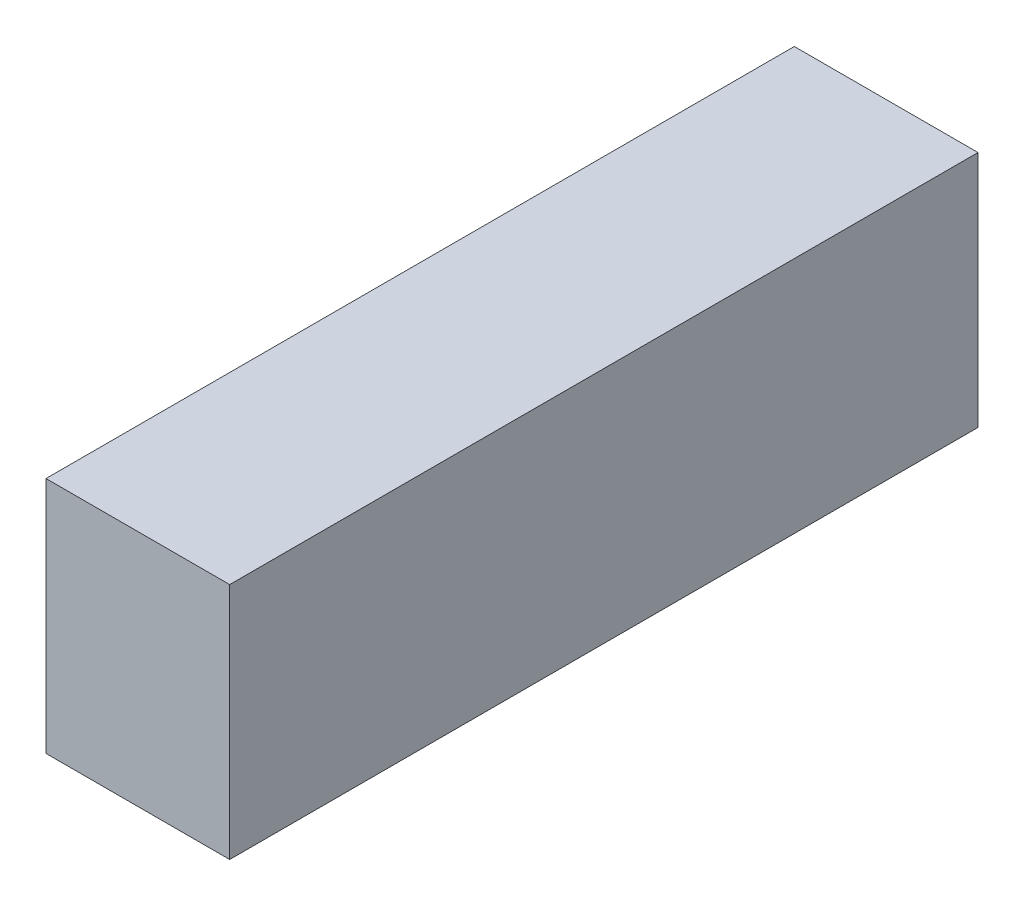
ISO-10303-21;
HEADER;
FILE_DESCRIPTION(('STEP AP214'),'2;1');
FILE_NAME('part.step','',(''),(''),'','','');
FILE_SCHEMA(('AUTOMOTIVE_DESIGN { 1 0 10303 214 1 1 1 1 }'));
ENDSEC;
DATA;
#1=APPLICATION_CONTEXT('core data for automotive mechanical design processes');
#2=APPLICATION_PROTOCOL_DEFINITION('international standard','automotive_design',2000,#1);
#3=PRODUCT_CONTEXT('',#1,'mechanical');
#4=PRODUCT('Part','Part','',(#3));
#5=PRODUCT_RELATED_PRODUCT_CATEGORY('part','',(#4));
#6=PRODUCT_DEFINITION_FORMATION('','',#4);
#7=PRODUCT_DEFINITION_CONTEXT('part definition',#1,'design');
#8=PRODUCT_DEFINITION('design','',#6,#7);
#9=PRODUCT_DEFINITION_SHAPE('','',#8);
#10=(LENGTH_UNIT() NAMED_UNIT(*) SI_UNIT(.MILLI.,.METRE.));
#11=(NAMED_UNIT(*) PLANE_ANGLE_UNIT() SI_UNIT($,.RADIAN.));
#12=(NAMED_UNIT(*) SI_UNIT($,.STERADIAN.) SOLID_ANGLE_UNIT());
#13=UNCERTAINTY_MEASURE_WITH_UNIT(LENGTH_MEASURE(1.E-05),#10,'distance_accuracy_value','');
#14=(GEOMETRIC_REPRESENTATION_CONTEXT(3) GLOBAL_UNCERTAINTY_ASSIGNED_CONTEXT((#13)) GLOBAL_UNIT_ASSIGNED_CONTEXT((#10,
#11,#12)) REPRESENTATION_CONTEXT('',''));
#15=CARTESIAN_POINT('',(0.,0.,0.));
#16=DIRECTION('',(0.,0.,1.));
#17=DIRECTION('',(1.,0.,0.));
#18=AXIS2_PLACEMENT_3D('',#15,#16,#17);
#19=CARTESIAN_POINT('',(8.57249999999999,11.1125,34.925));
#20=DIRECTION('',(-1.,0.,0.));
#21=DIRECTION('',(0.,0.,1.));
#22=AXIS2_PLACEMENT_3D('',#19,#20,#21);
#23=PLANE('',#22);
#24=DIRECTION('',(0.,0.,-1.));
#25=VECTOR('',#24,1.);
#26=CARTESIAN_POINT('',(8.57249999999999,-11.1125,34.925));
#27=LINE('',#26,#25);
#28=CARTESIAN_POINT('',(8.57249999999999,-11.1125,34.925));
#29=VERTEX_POINT('',#28);
#30=CARTESIAN_POINT('',(8.57249999999999,-11.1125,-34.925));
#31=VERTEX_POINT('',#30);
#32=EDGE_CURVE('E98',#29,#31,#27,.T.);
#33=ORIENTED_EDGE('',*,*,#32,.T.);
#34=DIRECTION('',(0.,-1.,0.));
#35=VECTOR('',#34,1.);
#36=CARTESIAN_POINT('',(8.57249999999999,11.1125,-34.925));
#37=LINE('',#36,#35);
#38=CARTESIAN_POINT('',(8.57249999999999,11.1125,-34.925));
#39=VERTEX_POINT('',#38);
#40=EDGE_CURVE('E11',#39,#31,#37,.T.);
#41=ORIENTED_EDGE('',*,*,#40,.F.);
#42=DIRECTION('',(0.,0.,-1.));
#43=VECTOR('',#42,1.);
#44=CARTESIAN_POINT('',(8.57249999999999,11.1125,34.925));
#45=LINE('',#44,#43);
#46=CARTESIAN_POINT('',(8.57249999999999,11.1125,34.925));
#47=VERTEX_POINT('',#46);
#48=EDGE_CURVE('E86',#47,#39,#45,.T.);
#49=ORIENTED_EDGE('',*,*,#48,.F.);
#50=DIRECTION('',(0.,-1.,0.));
#51=VECTOR('',#50,1.);
#52=CARTESIAN_POINT('',(8.57249999999999,11.1125,34.925));
#53=LINE('',#52,#51);
#54=EDGE_CURVE('E94',#47,#29,#53,.T.);
#55=ORIENTED_EDGE('',*,*,#54,.T.);
#56=EDGE_LOOP('',(#33,#41,#49,#55));
#57=FACE_BOUND('',#56,.T.);
#58=ADVANCED_FACE('F35',(#57),#23,.F.);
#59=CARTESIAN_POINT('',(-8.57250000000001,11.1125,-34.925));
#60=DIRECTION('',(0.,0.,1.));
#61=DIRECTION('',(1.,0.,0.));
#62=AXIS2_PLACEMENT_3D('',#59,#60,#61);
#63=PLANE('',#62);
#64=DIRECTION('',(-1.,0.,0.));
#65=VECTOR('',#64,1.);
#66=CARTESIAN_POINT('',(-8.57250000000001,-11.1125,-34.925));
#67=LINE('',#66,#65);
#68=CARTESIAN_POINT('',(-8.57250000000001,-11.1125,-34.925));
#69=VERTEX_POINT('',#68);
#70=EDGE_CURVE('E90',#31,#69,#67,.T.);
#71=ORIENTED_EDGE('',*,*,#70,.T.);
#72=DIRECTION('',(0.,-1.,0.));
#73=VECTOR('',#72,1.);
#74=CARTESIAN_POINT('',(-8.57250000000001,11.1125,-34.925));
#75=LINE('',#74,#73);
#76=CARTESIAN_POINT('',(-8.57250000000001,11.1125,-34.925));
#77=VERTEX_POINT('',#76);
#78=EDGE_CURVE('E43',#77,#69,#75,.T.);
#79=ORIENTED_EDGE('',*,*,#78,.F.);
#80=DIRECTION('',(-1.,0.,0.));
#81=VECTOR('',#80,1.);
#82=CARTESIAN_POINT('',(-8.57250000000001,11.1125,-34.925));
#83=LINE('',#82,#81);
#84=EDGE_CURVE('E81',#39,#77,#83,.T.);
#85=ORIENTED_EDGE('',*,*,#84,.F.);
#86=ORIENTED_EDGE('',*,*,#40,.T.);
#87=EDGE_LOOP('',(#71,#79,#85,#86));
#88=FACE_BOUND('',#87,.T.);
#89=ADVANCED_FACE('F89',(#88),#63,.F.);
#90=CARTESIAN_POINT('',(-8.57250000000001,11.1125,34.925));
#91=DIRECTION('',(1.,0.,0.));
#92=DIRECTION('',(0.,0.,-1.));
#93=AXIS2_PLACEMENT_3D('',#90,#91,#92);
#94=PLANE('',#93);
#95=DIRECTION('',(0.,0.,1.));
#96=VECTOR('',#95,1.);
#97=CARTESIAN_POINT('',(-8.57250000000001,-11.1125,34.925));
#98=LINE('',#97,#96);
#99=CARTESIAN_POINT('',(-8.57250000000001,-11.1125,34.925));
#100=VERTEX_POINT('',#99);
#101=EDGE_CURVE('E68',#69,#100,#98,.T.);
#102=ORIENTED_EDGE('',*,*,#101,.T.);
#103=DIRECTION('',(0.,-1.,0.));
#104=VECTOR('',#103,1.);
#105=CARTESIAN_POINT('',(-8.57250000000001,11.1125,34.925));
#106=LINE('',#105,#104);
#107=CARTESIAN_POINT('',(-8.57250000000001,11.1125,34.925));
#108=VERTEX_POINT('',#107);
#109=EDGE_CURVE('E91',#108,#100,#106,.T.);
#110=ORIENTED_EDGE('',*,*,#109,.F.);
#111=DIRECTION('',(0.,0.,1.));
#112=VECTOR('',#111,1.);
#113=CARTESIAN_POINT('',(-8.57250000000001,11.1125,34.925));
#114=LINE('',#113,#112);
#115=EDGE_CURVE('E84',#77,#108,#114,.T.);
#116=ORIENTED_EDGE('',*,*,#115,.F.);
#117=ORIENTED_EDGE('',*,*,#78,.T.);
#118=EDGE_LOOP('',(#102,#110,#116,#117));
#119=FACE_BOUND('',#118,.T.);
#120=ADVANCED_FACE('F92',(#119),#94,.F.);
#121=CARTESIAN_POINT('',(-8.57250000000001,11.1125,34.925));
#122=DIRECTION('',(0.,0.,-1.));
#123=DIRECTION('',(-1.,0.,0.));
#124=AXIS2_PLACEMENT_3D('',#121,#122,#123);
#125=PLANE('',#124);
#126=DIRECTION('',(1.,0.,0.));
#127=VECTOR('',#126,1.);
#128=CARTESIAN_POINT('',(-8.57250000000001,-11.1125,34.925));
#129=LINE('',#128,#127);
#130=EDGE_CURVE('E74',#100,#29,#129,.T.);
#131=ORIENTED_EDGE('',*,*,#130,.T.);
#132=ORIENTED_EDGE('',*,*,#54,.F.);
#133=DIRECTION('',(1.,0.,0.));
#134=VECTOR('',#133,1.);
#135=CARTESIAN_POINT('',(-8.57250000000001,11.1125,34.925));
#136=LINE('',#135,#134);
#137=EDGE_CURVE('E51',#108,#47,#136,.T.);
#138=ORIENTED_EDGE('',*,*,#137,.F.);
#139=ORIENTED_EDGE('',*,*,#109,.T.);
#140=EDGE_LOOP('',(#131,#132,#138,#139));
#141=FACE_BOUND('',#140,.T.);
#142=ADVANCED_FACE('F105',(#141),#125,.F.);
#143=CARTESIAN_POINT('',(0.,11.1125,0.));
#144=DIRECTION('',(0.,-1.,0.));
#145=DIRECTION('',(0.,0.,-1.));
#146=AXIS2_PLACEMENT_3D('',#143,#144,#145);
#147=PLANE('',#146);
#148=ORIENTED_EDGE('',*,*,#48,.T.);
#149=ORIENTED_EDGE('',*,*,#84,.T.);
#150=ORIENTED_EDGE('',*,*,#115,.T.);
#151=ORIENTED_EDGE('',*,*,#137,.T.);
#152=EDGE_LOOP('',(#148,#149,#150,#151));
#153=FACE_BOUND('',#152,.T.);
#154=ADVANCED_FACE('F82',(#153),#147,.F.);
#155=CARTESIAN_POINT('',(0.,-11.1125,0.));
#156=DIRECTION('',(0.,-1.,0.));
#157=DIRECTION('',(0.,0.,-1.));
#158=AXIS2_PLACEMENT_3D('',#155,#156,#157);
#159=PLANE('',#158);
#160=ORIENTED_EDGE('',*,*,#32,.F.);
#161=ORIENTED_EDGE('',*,*,#130,.F.);
#162=ORIENTED_EDGE('',*,*,#101,.F.);
#163=ORIENTED_EDGE('',*,*,#70,.F.);
#164=EDGE_LOOP('',(#160,#161,#162,#163));
#165=FACE_BOUND('',#164,.T.);
#166=ADVANCED_FACE('F108',(#165),#159,.T.);
#167=CLOSED_SHELL('',(#58,#89,#120,#142,#154,#166));
#168=MANIFOLD_SOLID_BREP('B2',#167);
#169=ADVANCED_BREP_SHAPE_REPRESENTATION('',(#18,#168),#14);
#170=SHAPE_DEFINITION_REPRESENTATION(#9,#169);
ENDSEC;
END-ISO-10303-21;
